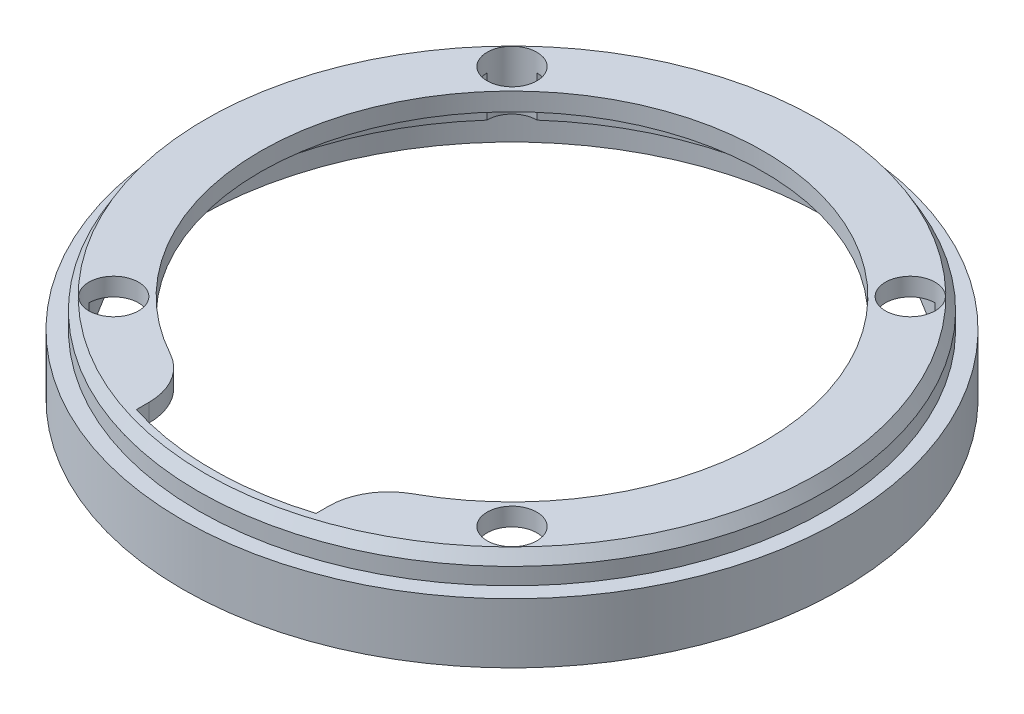
ISO-10303-21;
HEADER;
FILE_DESCRIPTION(('STEP AP214'),'2;1');
FILE_NAME('part.step','',(''),(''),'','','');
FILE_SCHEMA(('AUTOMOTIVE_DESIGN { 1 0 10303 214 1 1 1 1 }'));
ENDSEC;
DATA;
#1=APPLICATION_CONTEXT('core data for automotive mechanical design processes');
#2=APPLICATION_PROTOCOL_DEFINITION('international standard','automotive_design',2000,#1);
#3=PRODUCT_CONTEXT('',#1,'mechanical');
#4=PRODUCT('Part','Part','',(#3));
#5=PRODUCT_RELATED_PRODUCT_CATEGORY('part','',(#4));
#6=PRODUCT_DEFINITION_FORMATION('','',#4);
#7=PRODUCT_DEFINITION_CONTEXT('part definition',#1,'design');
#8=PRODUCT_DEFINITION('design','',#6,#7);
#9=PRODUCT_DEFINITION_SHAPE('','',#8);
#10=(LENGTH_UNIT() NAMED_UNIT(*) SI_UNIT(.MILLI.,.METRE.));
#11=(NAMED_UNIT(*) PLANE_ANGLE_UNIT() SI_UNIT($,.RADIAN.));
#12=(NAMED_UNIT(*) SI_UNIT($,.STERADIAN.) SOLID_ANGLE_UNIT());
#13=UNCERTAINTY_MEASURE_WITH_UNIT(LENGTH_MEASURE(1.E-05),#10,'distance_accuracy_value','');
#14=(GEOMETRIC_REPRESENTATION_CONTEXT(3) GLOBAL_UNCERTAINTY_ASSIGNED_CONTEXT((#13)) GLOBAL_UNIT_ASSIGNED_CONTEXT((#10,
#11,#12)) REPRESENTATION_CONTEXT('',''));
#15=CARTESIAN_POINT('',(0.,0.,0.));
#16=DIRECTION('',(0.,0.,1.));
#17=DIRECTION('',(1.,0.,0.));
#18=AXIS2_PLACEMENT_3D('',#15,#16,#17);
#19=CARTESIAN_POINT('',(0.,14.8,0.));
#20=DIRECTION('',(0.,-1.,0.));
#21=DIRECTION('',(0.,0.,-1.));
#22=AXIS2_PLACEMENT_3D('',#19,#20,#21);
#23=CYLINDRICAL_SURFACE('',#22,50.);
#24=DIRECTION('',(0.,1.,0.));
#25=VECTOR('',#24,1.);
#26=CARTESIAN_POINT('',(-33.203068739609,7.4,-37.383903304401));
#27=LINE('',#26,#25);
#28=CARTESIAN_POINT('',(-33.203068739609,5.,-37.383903304401));
#29=VERTEX_POINT('',#28);
#30=CARTESIAN_POINT('',(-33.203068739609,11.8,-37.383903304401));
#31=VERTEX_POINT('',#30);
#32=EDGE_CURVE('E155',#29,#31,#27,.T.);
#33=ORIENTED_EDGE('',*,*,#32,.F.);
#34=CARTESIAN_POINT('',(0.,5.,0.));
#35=DIRECTION('',(0.,-1.,0.));
#36=DIRECTION('',(0.,0.,-1.));
#37=AXIS2_PLACEMENT_3D('',#34,#35,#36);
#38=CIRCLE('',#37,50.);
#39=CARTESIAN_POINT('',(33.203068739609,5.,-37.383903304401));
#40=VERTEX_POINT('',#39);
#41=EDGE_CURVE('E52',#29,#40,#38,.T.);
#42=ORIENTED_EDGE('',*,*,#41,.T.);
#43=DIRECTION('',(0.,1.,0.));
#44=VECTOR('',#43,1.);
#45=CARTESIAN_POINT('',(33.203068739609,7.4,-37.383903304401));
#46=LINE('',#45,#44);
#47=CARTESIAN_POINT('',(33.203068739609,11.8,-37.3839033044009));
#48=VERTEX_POINT('',#47);
#49=EDGE_CURVE('E160',#48,#40,#46,.F.);
#50=ORIENTED_EDGE('',*,*,#49,.F.);
#51=CARTESIAN_POINT('',(0.,11.8,0.));
#52=DIRECTION('',(0.,-1.,0.));
#53=DIRECTION('',(0.,0.,-1.));
#54=AXIS2_PLACEMENT_3D('',#51,#52,#53);
#55=CIRCLE('',#54,50.);
#56=EDGE_CURVE('E283',#31,#48,#55,.T.);
#57=ORIENTED_EDGE('',*,*,#56,.F.);
#58=EDGE_LOOP('',(#33,#42,#50,#57));
#59=FACE_BOUND('',#58,.T.);
#60=ADVANCED_FACE('F38',(#59),#23,.F.);
#61=DIRECTION('',(0.,1.,0.));
#62=VECTOR('',#61,1.);
#63=CARTESIAN_POINT('',(37.383903304401,7.4,-33.203068739609));
#64=LINE('',#63,#62);
#65=CARTESIAN_POINT('',(37.383903304401,5.,-33.203068739609));
#66=VERTEX_POINT('',#65);
#67=CARTESIAN_POINT('',(37.383903304401,11.8,-33.203068739609));
#68=VERTEX_POINT('',#67);
#69=EDGE_CURVE('E156',#66,#68,#64,.T.);
#70=ORIENTED_EDGE('',*,*,#69,.F.);
#71=CARTESIAN_POINT('',(0.,5.,0.));
#72=DIRECTION('',(0.,-1.,0.));
#73=DIRECTION('',(0.,0.,-1.));
#74=AXIS2_PLACEMENT_3D('',#71,#72,#73);
#75=CIRCLE('',#74,50.);
#76=CARTESIAN_POINT('',(37.383903304401,5.,33.203068739609));
#77=VERTEX_POINT('',#76);
#78=EDGE_CURVE('E315',#66,#77,#75,.T.);
#79=ORIENTED_EDGE('',*,*,#78,.T.);
#80=DIRECTION('',(0.,1.,0.));
#81=VECTOR('',#80,1.);
#82=CARTESIAN_POINT('',(37.383903304401,7.4,33.203068739609));
#83=LINE('',#82,#81);
#84=CARTESIAN_POINT('',(37.383903304401,11.8,33.203068739609));
#85=VERTEX_POINT('',#84);
#86=EDGE_CURVE('E266',#85,#77,#83,.F.);
#87=ORIENTED_EDGE('',*,*,#86,.F.);
#88=EDGE_CURVE('E290',#68,#85,#55,.T.);
#89=ORIENTED_EDGE('',*,*,#88,.F.);
#90=EDGE_LOOP('',(#70,#79,#87,#89));
#91=FACE_BOUND('',#90,.T.);
#92=ADVANCED_FACE('F362',(#91),#23,.F.);
#93=DIRECTION('',(0.,1.,0.));
#94=VECTOR('',#93,1.);
#95=CARTESIAN_POINT('',(33.203068739609,7.4,37.383903304401));
#96=LINE('',#95,#94);
#97=CARTESIAN_POINT('',(33.203068739609,5.,37.383903304401));
#98=VERTEX_POINT('',#97);
#99=CARTESIAN_POINT('',(33.203068739609,11.8,37.3839033044009));
#100=VERTEX_POINT('',#99);
#101=EDGE_CURVE('E270',#98,#100,#96,.T.);
#102=ORIENTED_EDGE('',*,*,#101,.F.);
#103=CARTESIAN_POINT('',(0.,5.,0.));
#104=DIRECTION('',(0.,-1.,0.));
#105=DIRECTION('',(0.,0.,-1.));
#106=AXIS2_PLACEMENT_3D('',#103,#104,#105);
#107=CIRCLE('',#106,50.);
#108=CARTESIAN_POINT('',(-33.203068739609,5.,37.383903304401));
#109=VERTEX_POINT('',#108);
#110=EDGE_CURVE('E318',#98,#109,#107,.T.);
#111=ORIENTED_EDGE('',*,*,#110,.T.);
#112=DIRECTION('',(0.,1.,0.));
#113=VECTOR('',#112,1.);
#114=CARTESIAN_POINT('',(-33.203068739609,7.4,37.383903304401));
#115=LINE('',#114,#113);
#116=CARTESIAN_POINT('',(-33.203068739609,11.8,37.383903304401));
#117=VERTEX_POINT('',#116);
#118=EDGE_CURVE('E166',#117,#109,#115,.F.);
#119=ORIENTED_EDGE('',*,*,#118,.F.);
#120=CARTESIAN_POINT('',(-15.,11.8,47.6969600708473));
#121=VERTEX_POINT('',#120);
#122=EDGE_CURVE('E289',#121,#117,#55,.T.);
#123=ORIENTED_EDGE('',*,*,#122,.F.);
#124=DIRECTION('',(0.,-1.,0.));
#125=VECTOR('',#124,1.);
#126=CARTESIAN_POINT('',(-15.,14.8,47.6969600708473));
#127=LINE('',#126,#125);
#128=CARTESIAN_POINT('',(-15.,14.8,47.6969600708473));
#129=VERTEX_POINT('',#128);
#130=EDGE_CURVE('E287',#129,#121,#127,.T.);
#131=ORIENTED_EDGE('',*,*,#130,.F.);
#132=CARTESIAN_POINT('',(0.,14.8,-3.9343528435154E-12));
#133=DIRECTION('',(0.,-1.,0.));
#134=DIRECTION('',(0.,0.,-1.));
#135=AXIS2_PLACEMENT_3D('',#132,#133,#134);
#136=CIRCLE('',#135,50.0000000000038);
#137=CARTESIAN_POINT('',(15.,14.8,47.6969600708473));
#138=VERTEX_POINT('',#137);
#139=EDGE_CURVE('E238',#138,#129,#136,.T.);
#140=ORIENTED_EDGE('',*,*,#139,.F.);
#141=DIRECTION('',(0.,-1.,0.));
#142=VECTOR('',#141,1.);
#143=CARTESIAN_POINT('',(15.,14.8,47.6969600708473));
#144=LINE('',#143,#142);
#145=CARTESIAN_POINT('',(15.,11.8,47.6969600708473));
#146=VERTEX_POINT('',#145);
#147=EDGE_CURVE('E240',#138,#146,#144,.T.);
#148=ORIENTED_EDGE('',*,*,#147,.T.);
#149=EDGE_CURVE('E291',#100,#146,#55,.T.);
#150=ORIENTED_EDGE('',*,*,#149,.F.);
#151=EDGE_LOOP('',(#102,#111,#119,#123,#131,#140,#148,#150));
#152=FACE_BOUND('',#151,.T.);
#153=ADVANCED_FACE('F302',(#152),#23,.F.);
#154=DIRECTION('',(0.,1.,0.));
#155=VECTOR('',#154,1.);
#156=CARTESIAN_POINT('',(-37.383903304401,7.4,33.203068739609));
#157=LINE('',#156,#155);
#158=CARTESIAN_POINT('',(-37.3839033044009,5.,33.203068739609));
#159=VERTEX_POINT('',#158);
#160=CARTESIAN_POINT('',(-37.3839033044009,11.8,33.203068739609));
#161=VERTEX_POINT('',#160);
#162=EDGE_CURVE('E148',#159,#161,#157,.T.);
#163=ORIENTED_EDGE('',*,*,#162,.F.);
#164=CARTESIAN_POINT('',(0.,5.,0.));
#165=DIRECTION('',(0.,-1.,0.));
#166=DIRECTION('',(0.,0.,-1.));
#167=AXIS2_PLACEMENT_3D('',#164,#165,#166);
#168=CIRCLE('',#167,50.);
#169=CARTESIAN_POINT('',(-37.383903304401,5.,-33.203068739609));
#170=VERTEX_POINT('',#169);
#171=EDGE_CURVE('E137',#159,#170,#168,.T.);
#172=ORIENTED_EDGE('',*,*,#171,.T.);
#173=DIRECTION('',(0.,1.,0.));
#174=VECTOR('',#173,1.);
#175=CARTESIAN_POINT('',(-37.383903304401,7.4,-33.203068739609));
#176=LINE('',#175,#174);
#177=CARTESIAN_POINT('',(-37.3839033044009,11.8,-33.203068739609));
#178=VERTEX_POINT('',#177);
#179=EDGE_CURVE('E146',#178,#170,#176,.F.);
#180=ORIENTED_EDGE('',*,*,#179,.F.);
#181=EDGE_CURVE('E286',#161,#178,#55,.T.);
#182=ORIENTED_EDGE('',*,*,#181,.F.);
#183=EDGE_LOOP('',(#163,#172,#180,#182));
#184=FACE_BOUND('',#183,.T.);
#185=ADVANCED_FACE('F144',(#184),#23,.F.);
#186=CARTESIAN_POINT('',(-33.2340187157677,0.,33.2340187157678));
#187=DIRECTION('',(0.,1.,0.));
#188=DIRECTION('',(0.,0.,1.));
#189=AXIS2_PLACEMENT_3D('',#186,#187,#188);
#190=CYLINDRICAL_SURFACE('',#189,4.15);
#191=CARTESIAN_POINT('',(-33.2340187157677,14.8,33.2340187157678));
#192=DIRECTION('',(0.,1.,0.));
#193=DIRECTION('',(0.,0.,1.));
#194=AXIS2_PLACEMENT_3D('',#191,#192,#193);
#195=CIRCLE('',#194,4.15);
#196=CARTESIAN_POINT('',(-33.2340187157677,14.8,37.3840187157678));
#197=VERTEX_POINT('',#196);
#198=EDGE_CURVE('E158',#197,#197,#195,.T.);
#199=ORIENTED_EDGE('',*,*,#198,.T.);
#200=EDGE_LOOP('',(#199));
#201=FACE_BOUND('',#200,.T.);
#202=CARTESIAN_POINT('',(-33.2340187157677,5.,33.2340187157678));
#203=DIRECTION('',(0.,-1.,0.));
#204=DIRECTION('',(0.,0.,-1.));
#205=AXIS2_PLACEMENT_3D('',#202,#203,#204);
#206=CIRCLE('',#205,4.15);
#207=EDGE_CURVE('E320',#159,#109,#206,.F.);
#208=ORIENTED_EDGE('',*,*,#207,.F.);
#209=ORIENTED_EDGE('',*,*,#162,.T.);
#210=CARTESIAN_POINT('',(-33.2340187157677,11.8,33.2340187157678));
#211=DIRECTION('',(0.,-1.,0.));
#212=DIRECTION('',(0.,0.,-1.));
#213=AXIS2_PLACEMENT_3D('',#210,#211,#212);
#214=CIRCLE('',#213,4.15);
#215=EDGE_CURVE('E257',#117,#161,#214,.F.);
#216=ORIENTED_EDGE('',*,*,#215,.F.);
#217=ORIENTED_EDGE('',*,*,#118,.T.);
#218=EDGE_LOOP('',(#208,#209,#216,#217));
#219=FACE_BOUND('',#218,.T.);
#220=ADVANCED_FACE('F370',(#201,#219),#190,.F.);
#221=CARTESIAN_POINT('',(33.2340187157678,0.,33.2340187157677));
#222=DIRECTION('',(0.,1.,0.));
#223=DIRECTION('',(0.,0.,1.));
#224=AXIS2_PLACEMENT_3D('',#221,#222,#223);
#225=CYLINDRICAL_SURFACE('',#224,4.15);
#226=CARTESIAN_POINT('',(33.2340187157678,14.8,33.2340187157677));
#227=DIRECTION('',(0.,1.,0.));
#228=DIRECTION('',(0.,0.,1.));
#229=AXIS2_PLACEMENT_3D('',#226,#227,#228);
#230=CIRCLE('',#229,4.15);
#231=CARTESIAN_POINT('',(33.2340187157678,14.8,37.3840187157677));
#232=VERTEX_POINT('',#231);
#233=EDGE_CURVE('E224',#232,#232,#230,.T.);
#234=ORIENTED_EDGE('',*,*,#233,.T.);
#235=EDGE_LOOP('',(#234));
#236=FACE_BOUND('',#235,.T.);
#237=CARTESIAN_POINT('',(33.2340187157678,5.,33.2340187157677));
#238=DIRECTION('',(0.,-1.,0.));
#239=DIRECTION('',(0.,0.,-1.));
#240=AXIS2_PLACEMENT_3D('',#237,#238,#239);
#241=CIRCLE('',#240,4.15);
#242=EDGE_CURVE('E313',#98,#77,#241,.F.);
#243=ORIENTED_EDGE('',*,*,#242,.F.);
#244=ORIENTED_EDGE('',*,*,#101,.T.);
#245=CARTESIAN_POINT('',(33.2340187157678,11.8,33.2340187157677));
#246=DIRECTION('',(0.,-1.,0.));
#247=DIRECTION('',(0.,0.,-1.));
#248=AXIS2_PLACEMENT_3D('',#245,#246,#247);
#249=CIRCLE('',#248,4.15);
#250=EDGE_CURVE('E261',#85,#100,#249,.F.);
#251=ORIENTED_EDGE('',*,*,#250,.F.);
#252=ORIENTED_EDGE('',*,*,#86,.T.);
#253=EDGE_LOOP('',(#243,#244,#251,#252));
#254=FACE_BOUND('',#253,.T.);
#255=ADVANCED_FACE('F375',(#236,#254),#225,.F.);
#256=CARTESIAN_POINT('',(33.2340187157678,0.,-33.2340187157677));
#257=DIRECTION('',(0.,1.,0.));
#258=DIRECTION('',(0.,0.,1.));
#259=AXIS2_PLACEMENT_3D('',#256,#257,#258);
#260=CYLINDRICAL_SURFACE('',#259,4.15);
#261=CARTESIAN_POINT('',(33.2340187157678,14.8,-33.2340187157677));
#262=DIRECTION('',(0.,1.,0.));
#263=DIRECTION('',(0.,0.,1.));
#264=AXIS2_PLACEMENT_3D('',#261,#262,#263);
#265=CIRCLE('',#264,4.15);
#266=CARTESIAN_POINT('',(33.2340187157678,14.8,-29.0840187157677));
#267=VERTEX_POINT('',#266);
#268=EDGE_CURVE('E228',#267,#267,#265,.T.);
#269=ORIENTED_EDGE('',*,*,#268,.T.);
#270=EDGE_LOOP('',(#269));
#271=FACE_BOUND('',#270,.T.);
#272=CARTESIAN_POINT('',(33.2340187157678,5.,-33.2340187157677));
#273=DIRECTION('',(0.,-1.,0.));
#274=DIRECTION('',(0.,0.,-1.));
#275=AXIS2_PLACEMENT_3D('',#272,#273,#274);
#276=CIRCLE('',#275,4.15);
#277=EDGE_CURVE('E276',#66,#40,#276,.F.);
#278=ORIENTED_EDGE('',*,*,#277,.F.);
#279=ORIENTED_EDGE('',*,*,#69,.T.);
#280=CARTESIAN_POINT('',(33.2340187157678,11.8,-33.2340187157677));
#281=DIRECTION('',(0.,-1.,0.));
#282=DIRECTION('',(0.,0.,-1.));
#283=AXIS2_PLACEMENT_3D('',#280,#281,#282);
#284=CIRCLE('',#283,4.15);
#285=EDGE_CURVE('E279',#48,#68,#284,.F.);
#286=ORIENTED_EDGE('',*,*,#285,.F.);
#287=ORIENTED_EDGE('',*,*,#49,.T.);
#288=EDGE_LOOP('',(#278,#279,#286,#287));
#289=FACE_BOUND('',#288,.T.);
#290=ADVANCED_FACE('F275',(#271,#289),#260,.F.);
#291=CARTESIAN_POINT('',(-33.2340187157677,0.,-33.2340187157678));
#292=DIRECTION('',(0.,1.,0.));
#293=DIRECTION('',(0.,0.,1.));
#294=AXIS2_PLACEMENT_3D('',#291,#292,#293);
#295=CYLINDRICAL_SURFACE('',#294,4.15);
#296=CARTESIAN_POINT('',(-33.2340187157677,14.8,-33.2340187157678));
#297=DIRECTION('',(0.,1.,0.));
#298=DIRECTION('',(0.,0.,1.));
#299=AXIS2_PLACEMENT_3D('',#296,#297,#298);
#300=CIRCLE('',#299,4.15);
#301=CARTESIAN_POINT('',(-33.2340187157677,14.8,-29.0840187157678));
#302=VERTEX_POINT('',#301);
#303=EDGE_CURVE('E231',#302,#302,#300,.T.);
#304=ORIENTED_EDGE('',*,*,#303,.T.);
#305=EDGE_LOOP('',(#304));
#306=FACE_BOUND('',#305,.T.);
#307=CARTESIAN_POINT('',(-33.2340187157677,5.,-33.2340187157678));
#308=DIRECTION('',(0.,-1.,0.));
#309=DIRECTION('',(0.,0.,-1.));
#310=AXIS2_PLACEMENT_3D('',#307,#308,#309);
#311=CIRCLE('',#310,4.15);
#312=EDGE_CURVE('E12',#29,#170,#311,.F.);
#313=ORIENTED_EDGE('',*,*,#312,.F.);
#314=ORIENTED_EDGE('',*,*,#32,.T.);
#315=CARTESIAN_POINT('',(-33.2340187157677,11.8,-33.2340187157678));
#316=DIRECTION('',(0.,-1.,0.));
#317=DIRECTION('',(0.,0.,-1.));
#318=AXIS2_PLACEMENT_3D('',#315,#316,#317);
#319=CIRCLE('',#318,4.15);
#320=EDGE_CURVE('E154',#178,#31,#319,.F.);
#321=ORIENTED_EDGE('',*,*,#320,.F.);
#322=ORIENTED_EDGE('',*,*,#179,.T.);
#323=EDGE_LOOP('',(#313,#314,#321,#322));
#324=FACE_BOUND('',#323,.T.);
#325=ADVANCED_FACE('F152',(#306,#324),#295,.F.);
#326=CARTESIAN_POINT('',(0.,14.8,0.));
#327=DIRECTION('',(0.,-1.,0.));
#328=DIRECTION('',(0.,0.,-1.));
#329=AXIS2_PLACEMENT_3D('',#326,#327,#328);
#330=CYLINDRICAL_SURFACE('',#329,55.);
#331=CARTESIAN_POINT('',(0.,0.,0.));
#332=DIRECTION('',(0.,1.,0.));
#333=DIRECTION('',(0.,0.,1.));
#334=AXIS2_PLACEMENT_3D('',#331,#332,#333);
#335=CIRCLE('',#334,55.);
#336=CARTESIAN_POINT('',(0.,0.,55.));
#337=VERTEX_POINT('',#336);
#338=EDGE_CURVE('E173',#337,#337,#335,.T.);
#339=ORIENTED_EDGE('',*,*,#338,.T.);
#340=EDGE_LOOP('',(#339));
#341=FACE_BOUND('',#340,.T.);
#342=CARTESIAN_POINT('',(0.,10.,0.));
#343=DIRECTION('',(0.,1.,0.));
#344=DIRECTION('',(0.,0.,1.));
#345=AXIS2_PLACEMENT_3D('',#342,#343,#344);
#346=CIRCLE('',#345,55.);
#347=CARTESIAN_POINT('',(0.,10.,55.));
#348=VERTEX_POINT('',#347);
#349=EDGE_CURVE('E197',#348,#348,#346,.T.);
#350=ORIENTED_EDGE('',*,*,#349,.F.);
#351=EDGE_LOOP('',(#350));
#352=FACE_BOUND('',#351,.T.);
#353=ADVANCED_FACE('F217',(#341,#352),#330,.T.);
#354=CARTESIAN_POINT('',(0.,14.8,0.));
#355=DIRECTION('',(0.,1.,0.));
#356=DIRECTION('',(0.,0.,1.));
#357=AXIS2_PLACEMENT_3D('',#354,#355,#356);
#358=PLANE('',#357);
#359=CARTESIAN_POINT('',(0.,14.8,0.));
#360=DIRECTION('',(0.,1.,0.));
#361=DIRECTION('',(0.,0.,1.));
#362=AXIS2_PLACEMENT_3D('',#359,#360,#361);
#363=CIRCLE('',#362,51.1952994616208);
#364=CARTESIAN_POINT('',(0.,14.8,51.1952994616208));
#365=VERTEX_POINT('',#364);
#366=EDGE_CURVE('E196',#365,#365,#363,.T.);
#367=ORIENTED_EDGE('',*,*,#366,.T.);
#368=EDGE_LOOP('',(#367));
#369=FACE_BOUND('',#368,.T.);
#370=ORIENTED_EDGE('',*,*,#198,.F.);
#371=EDGE_LOOP('',(#370));
#372=FACE_BOUND('',#371,.T.);
#373=ORIENTED_EDGE('',*,*,#233,.F.);
#374=EDGE_LOOP('',(#373));
#375=FACE_BOUND('',#374,.T.);
#376=ORIENTED_EDGE('',*,*,#268,.F.);
#377=EDGE_LOOP('',(#376));
#378=FACE_BOUND('',#377,.T.);
#379=ORIENTED_EDGE('',*,*,#303,.F.);
#380=EDGE_LOOP('',(#379));
#381=FACE_BOUND('',#380,.T.);
#382=DIRECTION('',(0.,0.,-1.));
#383=VECTOR('',#382,1.);
#384=CARTESIAN_POINT('',(-15.,14.8,33.2340187157678));
#385=LINE('',#384,#383);
#386=CARTESIAN_POINT('',(-15.,14.8,45.596052460712));
#387=VERTEX_POINT('',#386);
#388=EDGE_CURVE('E235',#129,#387,#385,.T.);
#389=ORIENTED_EDGE('',*,*,#388,.T.);
#390=CARTESIAN_POINT('',(-25.,14.8,45.596052460712));
#391=DIRECTION('',(0.,1.,0.));
#392=DIRECTION('',(0.,0.,1.));
#393=AXIS2_PLACEMENT_3D('',#390,#391,#392);
#394=CIRCLE('',#393,10.);
#395=CARTESIAN_POINT('',(-20.1923076923077,14.8,36.827580833652));
#396=VERTEX_POINT('',#395);
#397=EDGE_CURVE('E192',#387,#396,#394,.T.);
#398=ORIENTED_EDGE('',*,*,#397,.T.);
#399=CARTESIAN_POINT('',(0.,14.8,0.));
#400=DIRECTION('',(0.,1.,0.));
#401=DIRECTION('',(0.,0.,1.));
#402=AXIS2_PLACEMENT_3D('',#399,#400,#401);
#403=CIRCLE('',#402,42.);
#404=CARTESIAN_POINT('',(20.1923076923077,14.8,36.827580833652));
#405=VERTEX_POINT('',#404);
#406=EDGE_CURVE('E170',#405,#396,#403,.T.);
#407=ORIENTED_EDGE('',*,*,#406,.F.);
#408=CARTESIAN_POINT('',(25.,14.8,45.596052460712));
#409=DIRECTION('',(0.,1.,0.));
#410=DIRECTION('',(0.,0.,1.));
#411=AXIS2_PLACEMENT_3D('',#408,#409,#410);
#412=CIRCLE('',#411,10.);
#413=CARTESIAN_POINT('',(15.,14.8,45.596052460712));
#414=VERTEX_POINT('',#413);
#415=EDGE_CURVE('E60',#405,#414,#412,.T.);
#416=ORIENTED_EDGE('',*,*,#415,.T.);
#417=DIRECTION('',(0.,0.,1.));
#418=VECTOR('',#417,1.);
#419=CARTESIAN_POINT('',(15.,14.8,33.2340187157678));
#420=LINE('',#419,#418);
#421=EDGE_CURVE('E307',#414,#138,#420,.T.);
#422=ORIENTED_EDGE('',*,*,#421,.T.);
#423=ORIENTED_EDGE('',*,*,#139,.T.);
#424=EDGE_LOOP('',(#389,#398,#407,#416,#422,#423));
#425=FACE_BOUND('',#424,.T.);
#426=ADVANCED_FACE('F213',(#369,#372,#375,#378,#381,#425),#358,.T.);
#427=CARTESIAN_POINT('',(0.,0.,0.));
#428=DIRECTION('',(0.,1.,0.));
#429=DIRECTION('',(0.,0.,1.));
#430=AXIS2_PLACEMENT_3D('',#427,#428,#429);
#431=CYLINDRICAL_SURFACE('',#430,42.);
#432=ORIENTED_EDGE('',*,*,#406,.T.);
#433=DIRECTION('',(0.,1.,0.));
#434=VECTOR('',#433,1.);
#435=CARTESIAN_POINT('',(-20.1923076923077,0.,36.827580833652));
#436=LINE('',#435,#434);
#437=CARTESIAN_POINT('',(-20.1923076923077,11.8,36.827580833652));
#438=VERTEX_POINT('',#437);
#439=EDGE_CURVE('E182',#396,#438,#436,.F.);
#440=ORIENTED_EDGE('',*,*,#439,.T.);
#441=CARTESIAN_POINT('',(0.,11.8,0.));
#442=DIRECTION('',(0.,-1.,0.));
#443=DIRECTION('',(0.,0.,-1.));
#444=AXIS2_PLACEMENT_3D('',#441,#442,#443);
#445=CIRCLE('',#444,42.);
#446=CARTESIAN_POINT('',(20.1923076923077,11.8,36.827580833652));
#447=VERTEX_POINT('',#446);
#448=EDGE_CURVE('E249',#447,#438,#445,.F.);
#449=ORIENTED_EDGE('',*,*,#448,.F.);
#450=DIRECTION('',(0.,1.,0.));
#451=VECTOR('',#450,1.);
#452=CARTESIAN_POINT('',(20.1923076923077,0.,36.827580833652));
#453=LINE('',#452,#451);
#454=EDGE_CURVE('E179',#447,#405,#453,.T.);
#455=ORIENTED_EDGE('',*,*,#454,.T.);
#456=EDGE_LOOP('',(#432,#440,#449,#455));
#457=FACE_BOUND('',#456,.T.);
#458=ADVANCED_FACE('F216',(#457),#431,.F.);
#459=CARTESIAN_POINT('',(0.,0.,0.));
#460=DIRECTION('',(0.,1.,0.));
#461=DIRECTION('',(0.,0.,1.));
#462=AXIS2_PLACEMENT_3D('',#459,#460,#461);
#463=PLANE('',#462);
#464=CARTESIAN_POINT('',(0.,0.,0.));
#465=DIRECTION('',(0.,-1.,0.));
#466=DIRECTION('',(0.,0.,-1.));
#467=AXIS2_PLACEMENT_3D('',#464,#465,#466);
#468=CIRCLE('',#467,52.5);
#469=CARTESIAN_POINT('',(0.,0.,-52.5));
#470=VERTEX_POINT('',#469);
#471=EDGE_CURVE('E324',#470,#470,#468,.T.);
#472=ORIENTED_EDGE('',*,*,#471,.F.);
#473=EDGE_LOOP('',(#472));
#474=FACE_BOUND('',#473,.T.);
#475=ORIENTED_EDGE('',*,*,#338,.F.);
#476=EDGE_LOOP('',(#475));
#477=FACE_BOUND('',#476,.T.);
#478=ADVANCED_FACE('F337',(#474,#477),#463,.F.);
#479=CARTESIAN_POINT('',(0.,11.8,0.));
#480=DIRECTION('',(0.,-1.,0.));
#481=DIRECTION('',(0.,0.,-1.));
#482=AXIS2_PLACEMENT_3D('',#479,#480,#481);
#483=PLANE('',#482);
#484=ORIENTED_EDGE('',*,*,#448,.T.);
#485=CARTESIAN_POINT('',(-25.,11.8,45.596052460712));
#486=DIRECTION('',(0.,-1.,0.));
#487=DIRECTION('',(0.,0.,-1.));
#488=AXIS2_PLACEMENT_3D('',#485,#486,#487);
#489=CIRCLE('',#488,10.);
#490=CARTESIAN_POINT('',(-15.,11.8,45.596052460712));
#491=VERTEX_POINT('',#490);
#492=EDGE_CURVE('E187',#438,#491,#489,.T.);
#493=ORIENTED_EDGE('',*,*,#492,.T.);
#494=DIRECTION('',(0.,0.,-1.));
#495=VECTOR('',#494,1.);
#496=CARTESIAN_POINT('',(-15.,11.8,33.2340187157678));
#497=LINE('',#496,#495);
#498=EDGE_CURVE('E200',#121,#491,#497,.T.);
#499=ORIENTED_EDGE('',*,*,#498,.F.);
#500=ORIENTED_EDGE('',*,*,#122,.T.);
#501=ORIENTED_EDGE('',*,*,#215,.T.);
#502=ORIENTED_EDGE('',*,*,#181,.T.);
#503=ORIENTED_EDGE('',*,*,#320,.T.);
#504=ORIENTED_EDGE('',*,*,#56,.T.);
#505=ORIENTED_EDGE('',*,*,#285,.T.);
#506=ORIENTED_EDGE('',*,*,#88,.T.);
#507=ORIENTED_EDGE('',*,*,#250,.T.);
#508=ORIENTED_EDGE('',*,*,#149,.T.);
#509=DIRECTION('',(0.,0.,1.));
#510=VECTOR('',#509,1.);
#511=CARTESIAN_POINT('',(15.,11.8,0.));
#512=LINE('',#511,#510);
#513=CARTESIAN_POINT('',(15.,11.8,45.596052460712));
#514=VERTEX_POINT('',#513);
#515=EDGE_CURVE('E177',#514,#146,#512,.T.);
#516=ORIENTED_EDGE('',*,*,#515,.F.);
#517=CARTESIAN_POINT('',(25.,11.8,45.596052460712));
#518=DIRECTION('',(0.,-1.,0.));
#519=DIRECTION('',(0.,0.,-1.));
#520=AXIS2_PLACEMENT_3D('',#517,#518,#519);
#521=CIRCLE('',#520,10.);
#522=EDGE_CURVE('E185',#514,#447,#521,.T.);
#523=ORIENTED_EDGE('',*,*,#522,.T.);
#524=EDGE_LOOP('',(#484,#493,#499,#500,#501,#502,#503,#504,#505,#506,#507,#508,#516,#523));
#525=FACE_BOUND('',#524,.T.);
#526=ADVANCED_FACE('F252',(#525),#483,.T.);
#527=CARTESIAN_POINT('',(-15.,14.8,33.2340187157678));
#528=DIRECTION('',(-1.,0.,0.));
#529=DIRECTION('',(0.,0.,1.));
#530=AXIS2_PLACEMENT_3D('',#527,#528,#529);
#531=PLANE('',#530);
#532=ORIENTED_EDGE('',*,*,#498,.T.);
#533=DIRECTION('',(0.,1.,0.));
#534=VECTOR('',#533,1.);
#535=CARTESIAN_POINT('',(-15.,14.8,45.596052460712));
#536=LINE('',#535,#534);
#537=EDGE_CURVE('E189',#491,#387,#536,.T.);
#538=ORIENTED_EDGE('',*,*,#537,.T.);
#539=ORIENTED_EDGE('',*,*,#388,.F.);
#540=ORIENTED_EDGE('',*,*,#130,.T.);
#541=EDGE_LOOP('',(#532,#538,#539,#540));
#542=FACE_BOUND('',#541,.T.);
#543=ADVANCED_FACE('F447',(#542),#531,.F.);
#544=CARTESIAN_POINT('',(15.,14.8,33.2340187157678));
#545=DIRECTION('',(1.,0.,0.));
#546=DIRECTION('',(0.,0.,-1.));
#547=AXIS2_PLACEMENT_3D('',#544,#545,#546);
#548=PLANE('',#547);
#549=ORIENTED_EDGE('',*,*,#421,.F.);
#550=DIRECTION('',(0.,1.,0.));
#551=VECTOR('',#550,1.);
#552=CARTESIAN_POINT('',(15.,14.8,45.596052460712));
#553=LINE('',#552,#551);
#554=EDGE_CURVE('E194',#414,#514,#553,.F.);
#555=ORIENTED_EDGE('',*,*,#554,.T.);
#556=ORIENTED_EDGE('',*,*,#515,.T.);
#557=ORIENTED_EDGE('',*,*,#147,.F.);
#558=EDGE_LOOP('',(#549,#555,#556,#557));
#559=FACE_BOUND('',#558,.T.);
#560=ADVANCED_FACE('F438',(#559),#548,.F.);
#561=CARTESIAN_POINT('',(-25.,0.,45.596052460712));
#562=DIRECTION('',(0.,1.,0.));
#563=DIRECTION('',(0.,0.,1.));
#564=AXIS2_PLACEMENT_3D('',#561,#562,#563);
#565=CYLINDRICAL_SURFACE('',#564,10.);
#566=ORIENTED_EDGE('',*,*,#397,.F.);
#567=ORIENTED_EDGE('',*,*,#537,.F.);
#568=ORIENTED_EDGE('',*,*,#492,.F.);
#569=ORIENTED_EDGE('',*,*,#439,.F.);
#570=EDGE_LOOP('',(#566,#567,#568,#569));
#571=FACE_BOUND('',#570,.T.);
#572=ADVANCED_FACE('F245',(#571),#565,.T.);
#573=CARTESIAN_POINT('',(25.,0.,45.596052460712));
#574=DIRECTION('',(0.,1.,0.));
#575=DIRECTION('',(0.,0.,1.));
#576=AXIS2_PLACEMENT_3D('',#573,#574,#575);
#577=CYLINDRICAL_SURFACE('',#576,10.);
#578=ORIENTED_EDGE('',*,*,#522,.F.);
#579=ORIENTED_EDGE('',*,*,#554,.F.);
#580=ORIENTED_EDGE('',*,*,#415,.F.);
#581=ORIENTED_EDGE('',*,*,#454,.F.);
#582=EDGE_LOOP('',(#578,#579,#580,#581));
#583=FACE_BOUND('',#582,.T.);
#584=ADVANCED_FACE('F350',(#583),#577,.T.);
#585=CARTESIAN_POINT('',(0.,10.,0.));
#586=DIRECTION('',(0.,1.,0.));
#587=DIRECTION('',(0.,0.,1.));
#588=AXIS2_PLACEMENT_3D('',#585,#586,#587);
#589=PLANE('',#588);
#590=CARTESIAN_POINT('',(0.,10.,0.));
#591=DIRECTION('',(0.,1.,0.));
#592=DIRECTION('',(0.,0.,1.));
#593=AXIS2_PLACEMENT_3D('',#590,#591,#592);
#594=CIRCLE('',#593,52.35);
#595=CARTESIAN_POINT('',(0.,10.,52.35));
#596=VERTEX_POINT('',#595);
#597=EDGE_CURVE('E201',#596,#596,#594,.T.);
#598=ORIENTED_EDGE('',*,*,#597,.F.);
#599=EDGE_LOOP('',(#598));
#600=FACE_BOUND('',#599,.T.);
#601=ORIENTED_EDGE('',*,*,#349,.T.);
#602=EDGE_LOOP('',(#601));
#603=FACE_BOUND('',#602,.T.);
#604=ADVANCED_FACE('F348',(#600,#603),#589,.T.);
#605=CARTESIAN_POINT('',(0.,10.,0.));
#606=DIRECTION('',(0.,1.,0.));
#607=DIRECTION('',(0.,0.,1.));
#608=AXIS2_PLACEMENT_3D('',#605,#606,#607);
#609=CYLINDRICAL_SURFACE('',#608,52.35);
#610=CARTESIAN_POINT('',(0.,12.8,0.));
#611=DIRECTION('',(0.,1.,0.));
#612=DIRECTION('',(0.,0.,1.));
#613=AXIS2_PLACEMENT_3D('',#610,#611,#612);
#614=CIRCLE('',#613,52.35);
#615=CARTESIAN_POINT('',(0.,12.8,52.35));
#616=VERTEX_POINT('',#615);
#617=EDGE_CURVE('E46',#616,#616,#614,.F.);
#618=ORIENTED_EDGE('',*,*,#617,.T.);
#619=EDGE_LOOP('',(#618));
#620=FACE_BOUND('',#619,.T.);
#621=ORIENTED_EDGE('',*,*,#597,.T.);
#622=EDGE_LOOP('',(#621));
#623=FACE_BOUND('',#622,.T.);
#624=ADVANCED_FACE('F206',(#620,#623),#609,.T.);
#625=CARTESIAN_POINT('',(0.,14.8,0.));
#626=DIRECTION('',(0.,-1.,0.));
#627=DIRECTION('',(0.,0.,-1.));
#628=AXIS2_PLACEMENT_3D('',#625,#626,#627);
#629=CONICAL_SURFACE('',#628,51.1952994616208,0.523598775598296);
#630=ORIENTED_EDGE('',*,*,#617,.F.);
#631=EDGE_LOOP('',(#630));
#632=FACE_BOUND('',#631,.T.);
#633=ORIENTED_EDGE('',*,*,#366,.F.);
#634=EDGE_LOOP('',(#633));
#635=FACE_BOUND('',#634,.T.);
#636=ADVANCED_FACE('F40',(#632,#635),#629,.T.);
#637=CARTESIAN_POINT('',(0.,5.,0.));
#638=DIRECTION('',(0.,-1.,0.));
#639=DIRECTION('',(0.,0.,-1.));
#640=AXIS2_PLACEMENT_3D('',#637,#638,#639);
#641=PLANE('',#640);
#642=CARTESIAN_POINT('',(0.,5.,0.));
#643=DIRECTION('',(0.,-1.,0.));
#644=DIRECTION('',(0.,0.,-1.));
#645=AXIS2_PLACEMENT_3D('',#642,#643,#644);
#646=CIRCLE('',#645,52.5);
#647=CARTESIAN_POINT('',(0.,5.,-52.5));
#648=VERTEX_POINT('',#647);
#649=EDGE_CURVE('E149',#648,#648,#646,.T.);
#650=ORIENTED_EDGE('',*,*,#649,.T.);
#651=EDGE_LOOP('',(#650));
#652=FACE_BOUND('',#651,.T.);
#653=ORIENTED_EDGE('',*,*,#242,.T.);
#654=ORIENTED_EDGE('',*,*,#78,.F.);
#655=ORIENTED_EDGE('',*,*,#277,.T.);
#656=ORIENTED_EDGE('',*,*,#41,.F.);
#657=ORIENTED_EDGE('',*,*,#312,.T.);
#658=ORIENTED_EDGE('',*,*,#171,.F.);
#659=ORIENTED_EDGE('',*,*,#207,.T.);
#660=ORIENTED_EDGE('',*,*,#110,.F.);
#661=EDGE_LOOP('',(#653,#654,#655,#656,#657,#658,#659,#660));
#662=FACE_BOUND('',#661,.T.);
#663=ADVANCED_FACE('F136',(#652,#662),#641,.T.);
#664=CARTESIAN_POINT('',(0.,5.,0.));
#665=DIRECTION('',(0.,-1.,0.));
#666=DIRECTION('',(0.,0.,-1.));
#667=AXIS2_PLACEMENT_3D('',#664,#665,#666);
#668=CYLINDRICAL_SURFACE('',#667,52.5);
#669=ORIENTED_EDGE('',*,*,#649,.F.);
#670=EDGE_LOOP('',(#669));
#671=FACE_BOUND('',#670,.T.);
#672=ORIENTED_EDGE('',*,*,#471,.T.);
#673=EDGE_LOOP('',(#672));
#674=FACE_BOUND('',#673,.T.);
#675=ADVANCED_FACE('F331',(#671,#674),#668,.F.);
#676=CLOSED_SHELL('',(#60,#92,#153,#185,#220,#255,#290,#325,#353,#426,#458,#478,#526,#543,#560,
#572,#584,#604,#624,#636,#663,#675));
#677=MANIFOLD_SOLID_BREP('B2',#676);
#678=ADVANCED_BREP_SHAPE_REPRESENTATION('',(#18,#677),#14);
#679=SHAPE_DEFINITION_REPRESENTATION(#9,#678);
ENDSEC;
END-ISO-10303-21;
